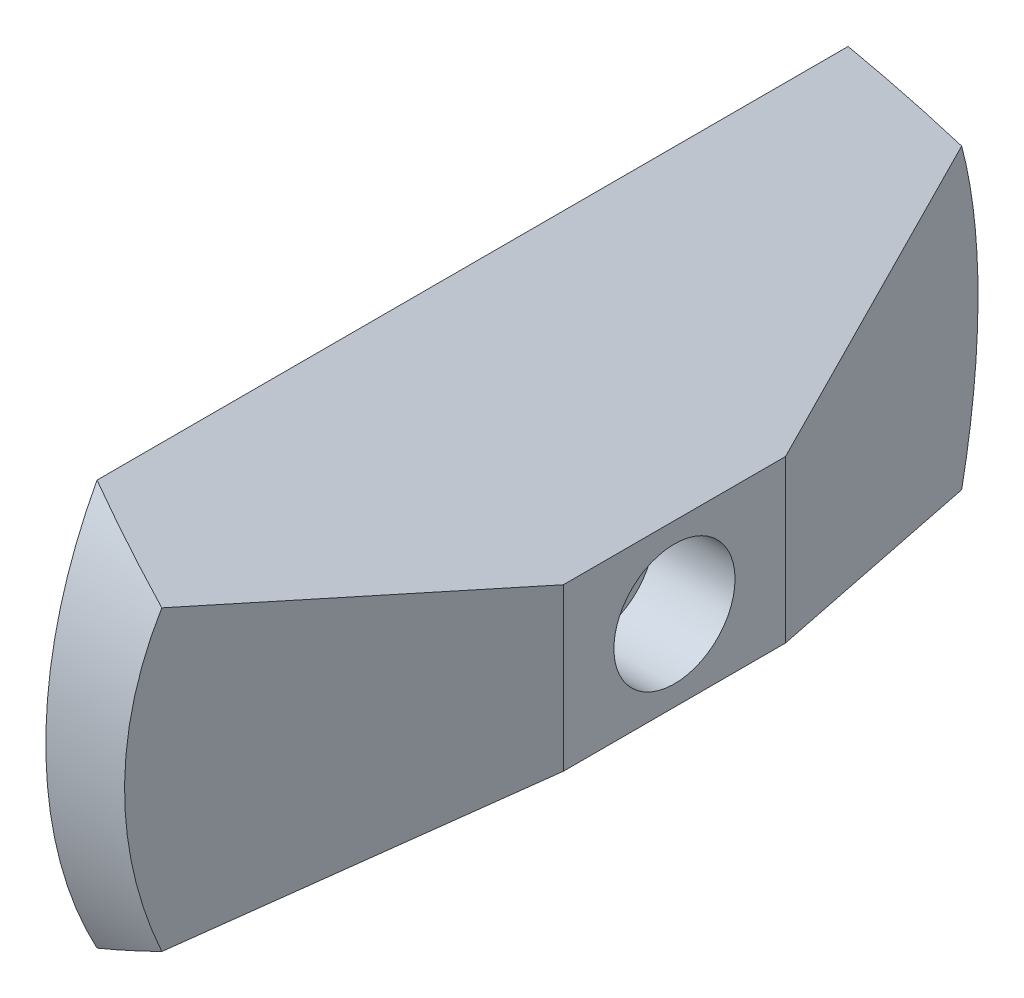
ISO-10303-21;
HEADER;
FILE_DESCRIPTION(('STEP AP214'),'2;1');
FILE_NAME('part.step','',(''),(''),'','','');
FILE_SCHEMA(('AUTOMOTIVE_DESIGN { 1 0 10303 214 1 1 1 1 }'));
ENDSEC;
DATA;
#1=APPLICATION_CONTEXT('core data for automotive mechanical design processes');
#2=APPLICATION_PROTOCOL_DEFINITION('international standard','automotive_design',2000,#1);
#3=PRODUCT_CONTEXT('',#1,'mechanical');
#4=PRODUCT('Part','Part','',(#3));
#5=PRODUCT_RELATED_PRODUCT_CATEGORY('part','',(#4));
#6=PRODUCT_DEFINITION_FORMATION('','',#4);
#7=PRODUCT_DEFINITION_CONTEXT('part definition',#1,'design');
#8=PRODUCT_DEFINITION('design','',#6,#7);
#9=PRODUCT_DEFINITION_SHAPE('','',#8);
#10=(LENGTH_UNIT() NAMED_UNIT(*) SI_UNIT(.MILLI.,.METRE.));
#11=(NAMED_UNIT(*) PLANE_ANGLE_UNIT() SI_UNIT($,.RADIAN.));
#12=(NAMED_UNIT(*) SI_UNIT($,.STERADIAN.) SOLID_ANGLE_UNIT());
#13=UNCERTAINTY_MEASURE_WITH_UNIT(LENGTH_MEASURE(1.E-05),#10,'distance_accuracy_value','');
#14=(GEOMETRIC_REPRESENTATION_CONTEXT(3) GLOBAL_UNCERTAINTY_ASSIGNED_CONTEXT((#13)) GLOBAL_UNIT_ASSIGNED_CONTEXT((#10,
#11,#12)) REPRESENTATION_CONTEXT('',''));
#15=CARTESIAN_POINT('',(0.,0.,0.));
#16=DIRECTION('',(0.,0.,1.));
#17=DIRECTION('',(1.,0.,0.));
#18=AXIS2_PLACEMENT_3D('',#15,#16,#17);
#19=CARTESIAN_POINT('',(55.3,10.66,42.5));
#20=DIRECTION('',(-1.,0.,0.));
#21=DIRECTION('',(0.,0.,1.));
#22=AXIS2_PLACEMENT_3D('',#19,#20,#21);
#23=PLANE('',#22);
#24=CARTESIAN_POINT('',(55.3,10.66,42.5));
#25=DIRECTION('',(-1.,0.,0.));
#26=DIRECTION('',(0.,0.,1.));
#27=AXIS2_PLACEMENT_3D('',#24,#25,#26);
#28=CIRCLE('',#27,1.5);
#29=CARTESIAN_POINT('',(55.3,12.16,42.5));
#30=VERTEX_POINT('',#29);
#31=CARTESIAN_POINT('',(55.3,10.66,41.));
#32=VERTEX_POINT('',#31);
#33=EDGE_CURVE('E146',#30,#32,#28,.T.);
#34=ORIENTED_EDGE('',*,*,#33,.F.);
#35=DIRECTION('',(0.,1.,0.));
#36=VECTOR('',#35,1.);
#37=CARTESIAN_POINT('',(55.3,13.16,42.5));
#38=LINE('',#37,#36);
#39=CARTESIAN_POINT('',(55.3,13.16,42.5));
#40=VERTEX_POINT('',#39);
#41=EDGE_CURVE('E184',#30,#40,#38,.T.);
#42=ORIENTED_EDGE('',*,*,#41,.T.);
#43=CARTESIAN_POINT('',(55.3,10.66,42.5));
#44=DIRECTION('',(-1.,0.,0.));
#45=DIRECTION('',(0.,0.,1.));
#46=AXIS2_PLACEMENT_3D('',#43,#44,#45);
#47=CIRCLE('',#46,2.5);
#48=CARTESIAN_POINT('',(55.3,10.66,40.));
#49=VERTEX_POINT('',#48);
#50=EDGE_CURVE('E441',#40,#49,#47,.T.);
#51=ORIENTED_EDGE('',*,*,#50,.T.);
#52=DIRECTION('',(0.,0.,1.));
#53=VECTOR('',#52,1.);
#54=CARTESIAN_POINT('',(55.3,10.66,40.));
#55=LINE('',#54,#53);
#56=EDGE_CURVE('E444',#49,#32,#55,.T.);
#57=ORIENTED_EDGE('',*,*,#56,.T.);
#58=EDGE_LOOP('',(#34,#42,#51,#57));
#59=FACE_BOUND('',#58,.T.);
#60=ADVANCED_FACE('F38',(#59),#23,.T.);
#61=CARTESIAN_POINT('',(39.3,10.66,42.5));
#62=DIRECTION('',(1.,0.,0.));
#63=DIRECTION('',(0.,0.,-1.));
#64=AXIS2_PLACEMENT_3D('',#61,#62,#63);
#65=CYLINDRICAL_SURFACE('',#64,21.1339271448186);
#66=CARTESIAN_POINT('',(52.3,10.66,42.5));
#67=DIRECTION('',(-1.,0.,0.));
#68=DIRECTION('',(0.,0.,1.));
#69=AXIS2_PLACEMENT_3D('',#66,#67,#68);
#70=CIRCLE('',#69,21.1339271448186);
#71=CARTESIAN_POINT('',(52.3,20.6975,23.9018422871377));
#72=VERTEX_POINT('',#71);
#73=CARTESIAN_POINT('',(52.3,0.622499999999996,23.9018422871377));
#74=VERTEX_POINT('',#73);
#75=EDGE_CURVE('E60',#72,#74,#70,.T.);
#76=ORIENTED_EDGE('',*,*,#75,.F.);
#77=CARTESIAN_POINT('',(68.9252587991718,10.66,42.5));
#78=DIRECTION('',(-0.51685430248884,-0.856073378863503,0.));
#79=DIRECTION('',(0.856073378863503,-0.51685430248884,0.));
#80=AXIS2_PLACEMENT_3D('',#77,#78,#79);
#81=ELLIPSE('',#80,40.8895254292188,21.1339271448186);
#82=CARTESIAN_POINT('',(56.7168174317577,18.0308464755763,22.6930946688791));
#83=VERTEX_POINT('',#82);
#84=EDGE_CURVE('E202',#83,#72,#81,.F.);
#85=ORIENTED_EDGE('',*,*,#84,.F.);
#86=CARTESIAN_POINT('',(64.4463414634146,10.66,42.5));
#87=DIRECTION('',(-0.93157761948506,0.,0.363542485652706));
#88=DIRECTION('',(0.363542485652706,0.,0.93157761948506));
#89=AXIS2_PLACEMENT_3D('',#86,#87,#88);
#90=ELLIPSE('',#89,22.6861688202649,21.1339271448186);
#91=CARTESIAN_POINT('',(56.7168174317577,3.28915352442372,22.6930946688791));
#92=VERTEX_POINT('',#91);
#93=EDGE_CURVE('E198',#92,#83,#90,.F.);
#94=ORIENTED_EDGE('',*,*,#93,.F.);
#95=CARTESIAN_POINT('',(68.9252587991718,10.66,42.5));
#96=DIRECTION('',(-0.51685430248884,0.856073378863503,0.));
#97=DIRECTION('',(0.856073378863503,0.51685430248884,0.));
#98=AXIS2_PLACEMENT_3D('',#95,#96,#97);
#99=ELLIPSE('',#98,40.8895254292188,21.1339271448186);
#100=EDGE_CURVE('E196',#74,#92,#99,.F.);
#101=ORIENTED_EDGE('',*,*,#100,.F.);
#102=EDGE_LOOP('',(#76,#85,#94,#101));
#103=FACE_BOUND('',#102,.T.);
#104=ADVANCED_FACE('F251',(#103),#65,.T.);
#105=CARTESIAN_POINT('',(52.3,10.66,42.5));
#106=DIRECTION('',(-1.,0.,0.));
#107=DIRECTION('',(0.,0.,1.));
#108=AXIS2_PLACEMENT_3D('',#105,#106,#107);
#109=CIRCLE('',#108,21.1339271448186);
#110=CARTESIAN_POINT('',(52.3,0.6225,61.0981577128623));
#111=VERTEX_POINT('',#110);
#112=CARTESIAN_POINT('',(52.3,20.6975,61.0981577128623));
#113=VERTEX_POINT('',#112);
#114=EDGE_CURVE('E187',#111,#113,#109,.T.);
#115=ORIENTED_EDGE('',*,*,#114,.F.);
#116=CARTESIAN_POINT('',(56.7168174317577,3.28915352442372,62.3069053311208));
#117=VERTEX_POINT('',#116);
#118=EDGE_CURVE('E199',#117,#111,#99,.F.);
#119=ORIENTED_EDGE('',*,*,#118,.F.);
#120=CARTESIAN_POINT('',(64.4463414634146,10.66,42.5));
#121=DIRECTION('',(-0.93157761948506,0.,-0.363542485652706));
#122=DIRECTION('',(0.363542485652706,0.,-0.93157761948506));
#123=AXIS2_PLACEMENT_3D('',#120,#121,#122);
#124=ELLIPSE('',#123,22.6861688202649,21.1339271448186);
#125=CARTESIAN_POINT('',(56.7168174317577,18.0308464755763,62.3069053311209));
#126=VERTEX_POINT('',#125);
#127=EDGE_CURVE('E206',#126,#117,#124,.F.);
#128=ORIENTED_EDGE('',*,*,#127,.F.);
#129=EDGE_CURVE('E205',#113,#126,#81,.F.);
#130=ORIENTED_EDGE('',*,*,#129,.F.);
#131=EDGE_LOOP('',(#115,#119,#128,#130));
#132=FACE_BOUND('',#131,.T.);
#133=ADVANCED_FACE('F247',(#132),#65,.T.);
#134=CARTESIAN_POINT('',(62.3,14.66,-8.00000000000005));
#135=DIRECTION('',(-0.51685430248884,-0.856073378863503,0.));
#136=DIRECTION('',(0.856073378863503,-0.51685430248884,0.));
#137=AXIS2_PLACEMENT_3D('',#134,#135,#136);
#138=PLANE('',#137);
#139=DIRECTION('',(0.,0.,-1.));
#140=VECTOR('',#139,1.);
#141=CARTESIAN_POINT('',(52.3,20.6975,-8.00000000000004));
#142=LINE('',#141,#140);
#143=EDGE_CURVE('E194',#113,#72,#142,.T.);
#144=ORIENTED_EDGE('',*,*,#143,.F.);
#145=ORIENTED_EDGE('',*,*,#129,.T.);
#146=DIRECTION('',(-0.355089807819902,0.214385471471266,0.9099176325385));
#147=VECTOR('',#146,1.);
#148=CARTESIAN_POINT('',(49.725674313885,22.2517491329919,80.2217095706697));
#149=LINE('',#148,#147);
#150=CARTESIAN_POINT('',(62.3,14.66,47.9999999999999));
#151=VERTEX_POINT('',#150);
#152=EDGE_CURVE('E226',#151,#126,#149,.T.);
#153=ORIENTED_EDGE('',*,*,#152,.F.);
#154=DIRECTION('',(0.,0.,1.));
#155=VECTOR('',#154,1.);
#156=CARTESIAN_POINT('',(62.3,14.66,-8.00000000000005));
#157=LINE('',#156,#155);
#158=CARTESIAN_POINT('',(62.3,14.66,37.));
#159=VERTEX_POINT('',#158);
#160=EDGE_CURVE('E215',#159,#151,#157,.T.);
#161=ORIENTED_EDGE('',*,*,#160,.F.);
#162=DIRECTION('',(0.355089807819902,-0.214385471471266,0.9099176325385));
#163=VECTOR('',#162,1.);
#164=CARTESIAN_POINT('',(49.725674313885,22.2517491329919,4.7782904293303));
#165=LINE('',#164,#163);
#166=EDGE_CURVE('E218',#83,#159,#165,.T.);
#167=ORIENTED_EDGE('',*,*,#166,.F.);
#168=ORIENTED_EDGE('',*,*,#84,.T.);
#169=EDGE_LOOP('',(#144,#145,#153,#161,#167,#168));
#170=FACE_BOUND('',#169,.T.);
#171=ADVANCED_FACE('F243',(#170),#138,.F.);
#172=CARTESIAN_POINT('',(62.3,6.66,-8.00000000000005));
#173=DIRECTION('',(-0.51685430248884,0.856073378863503,0.));
#174=DIRECTION('',(-0.856073378863503,-0.51685430248884,0.));
#175=AXIS2_PLACEMENT_3D('',#172,#173,#174);
#176=PLANE('',#175);
#177=DIRECTION('',(0.,0.,1.));
#178=VECTOR('',#177,1.);
#179=CARTESIAN_POINT('',(52.3,0.622499999999992,-8.00000000000004));
#180=LINE('',#179,#178);
#181=EDGE_CURVE('E11',#74,#111,#180,.T.);
#182=ORIENTED_EDGE('',*,*,#181,.F.);
#183=ORIENTED_EDGE('',*,*,#100,.T.);
#184=DIRECTION('',(-0.355089807819902,-0.214385471471266,-0.9099176325385));
#185=VECTOR('',#184,1.);
#186=CARTESIAN_POINT('',(44.9540906251225,-3.81259278508228,-7.44889277312355));
#187=LINE('',#186,#185);
#188=CARTESIAN_POINT('',(62.3,6.66,37.));
#189=VERTEX_POINT('',#188);
#190=EDGE_CURVE('E212',#189,#92,#187,.T.);
#191=ORIENTED_EDGE('',*,*,#190,.F.);
#192=DIRECTION('',(0.,0.,1.));
#193=VECTOR('',#192,1.);
#194=CARTESIAN_POINT('',(62.3,6.66,-8.00000000000005));
#195=LINE('',#194,#193);
#196=CARTESIAN_POINT('',(62.3,6.66,48.));
#197=VERTEX_POINT('',#196);
#198=EDGE_CURVE('E209',#189,#197,#195,.T.);
#199=ORIENTED_EDGE('',*,*,#198,.T.);
#200=DIRECTION('',(0.355089807819902,0.214385471471266,-0.9099176325385));
#201=VECTOR('',#200,1.);
#202=CARTESIAN_POINT('',(44.9540906251225,-3.81259278508229,92.4488927731236));
#203=LINE('',#202,#201);
#204=EDGE_CURVE('E46',#117,#197,#203,.T.);
#205=ORIENTED_EDGE('',*,*,#204,.F.);
#206=ORIENTED_EDGE('',*,*,#118,.T.);
#207=EDGE_LOOP('',(#182,#183,#191,#199,#205,#206));
#208=FACE_BOUND('',#207,.T.);
#209=ADVANCED_FACE('F236',(#208),#176,.F.);
#210=CARTESIAN_POINT('',(46.3,-20.68,-4.));
#211=DIRECTION('',(-0.93157761948506,0.,0.363542485652706));
#212=DIRECTION('',(0.363542485652706,0.,0.93157761948506));
#213=AXIS2_PLACEMENT_3D('',#210,#211,#212);
#214=PLANE('',#213);
#215=ORIENTED_EDGE('',*,*,#190,.T.);
#216=ORIENTED_EDGE('',*,*,#93,.T.);
#217=ORIENTED_EDGE('',*,*,#166,.T.);
#218=DIRECTION('',(0.,1.,0.));
#219=VECTOR('',#218,1.);
#220=CARTESIAN_POINT('',(62.3,0.,37.));
#221=LINE('',#220,#219);
#222=EDGE_CURVE('E220',#189,#159,#221,.T.);
#223=ORIENTED_EDGE('',*,*,#222,.F.);
#224=EDGE_LOOP('',(#215,#216,#217,#223));
#225=FACE_BOUND('',#224,.T.);
#226=ADVANCED_FACE('F253',(#225),#214,.F.);
#227=CARTESIAN_POINT('',(46.3,-20.68,89.));
#228=DIRECTION('',(-0.93157761948506,0.,-0.363542485652706));
#229=DIRECTION('',(-0.363542485652706,0.,0.93157761948506));
#230=AXIS2_PLACEMENT_3D('',#227,#228,#229);
#231=PLANE('',#230);
#232=ORIENTED_EDGE('',*,*,#152,.T.);
#233=ORIENTED_EDGE('',*,*,#127,.T.);
#234=ORIENTED_EDGE('',*,*,#204,.T.);
#235=DIRECTION('',(0.,-1.,0.));
#236=VECTOR('',#235,1.);
#237=CARTESIAN_POINT('',(62.3,0.,48.));
#238=LINE('',#237,#236);
#239=EDGE_CURVE('E223',#151,#197,#238,.T.);
#240=ORIENTED_EDGE('',*,*,#239,.F.);
#241=EDGE_LOOP('',(#232,#233,#234,#240));
#242=FACE_BOUND('',#241,.T.);
#243=ADVANCED_FACE('F231',(#242),#231,.F.);
#244=CARTESIAN_POINT('',(62.3,0.,0.));
#245=DIRECTION('',(-1.,0.,0.));
#246=DIRECTION('',(0.,0.,1.));
#247=AXIS2_PLACEMENT_3D('',#244,#245,#246);
#248=PLANE('',#247);
#249=CARTESIAN_POINT('',(62.3,10.66,42.5));
#250=DIRECTION('',(1.,0.,0.));
#251=DIRECTION('',(0.,0.,-1.));
#252=AXIS2_PLACEMENT_3D('',#249,#250,#251);
#253=CIRCLE('',#252,3.);
#254=CARTESIAN_POINT('',(62.3,10.66,39.5));
#255=VERTEX_POINT('',#254);
#256=EDGE_CURVE('E437',#255,#255,#253,.T.);
#257=ORIENTED_EDGE('',*,*,#256,.F.);
#258=EDGE_LOOP('',(#257));
#259=FACE_BOUND('',#258,.T.);
#260=ORIENTED_EDGE('',*,*,#239,.T.);
#261=ORIENTED_EDGE('',*,*,#198,.F.);
#262=ORIENTED_EDGE('',*,*,#222,.T.);
#263=ORIENTED_EDGE('',*,*,#160,.T.);
#264=EDGE_LOOP('',(#260,#261,#262,#263));
#265=FACE_BOUND('',#264,.T.);
#266=ADVANCED_FACE('F40',(#259,#265),#248,.F.);
#267=CARTESIAN_POINT('',(52.3,11.7228152902028,40.7144703124594));
#268=DIRECTION('',(-1.,0.,0.));
#269=DIRECTION('',(0.,0.,1.));
#270=AXIS2_PLACEMENT_3D('',#267,#268,#269);
#271=PLANE('',#270);
#272=CARTESIAN_POINT('',(52.3,10.66,42.5));
#273=DIRECTION('',(-1.,0.,0.));
#274=DIRECTION('',(0.,0.,1.));
#275=AXIS2_PLACEMENT_3D('',#272,#273,#274);
#276=CIRCLE('',#275,1.5);
#277=CARTESIAN_POINT('',(52.3,10.66,44.));
#278=VERTEX_POINT('',#277);
#279=CARTESIAN_POINT('',(52.3,12.16,42.5));
#280=VERTEX_POINT('',#279);
#281=EDGE_CURVE('E424',#278,#280,#276,.T.);
#282=ORIENTED_EDGE('',*,*,#281,.F.);
#283=DIRECTION('',(0.,0.,-1.));
#284=VECTOR('',#283,1.);
#285=CARTESIAN_POINT('',(52.3,10.66,43.5));
#286=LINE('',#285,#284);
#287=CARTESIAN_POINT('',(52.3,10.66,45.));
#288=VERTEX_POINT('',#287);
#289=EDGE_CURVE('E153',#288,#278,#286,.T.);
#290=ORIENTED_EDGE('',*,*,#289,.F.);
#291=CARTESIAN_POINT('',(52.3,10.66,42.5));
#292=DIRECTION('',(-1.,0.,0.));
#293=DIRECTION('',(0.,0.,1.));
#294=AXIS2_PLACEMENT_3D('',#291,#292,#293);
#295=CIRCLE('',#294,2.5);
#296=CARTESIAN_POINT('',(52.3,8.15999999999999,42.5));
#297=VERTEX_POINT('',#296);
#298=EDGE_CURVE('E180',#297,#288,#295,.T.);
#299=ORIENTED_EDGE('',*,*,#298,.F.);
#300=DIRECTION('',(0.,-1.,0.));
#301=VECTOR('',#300,1.);
#302=CARTESIAN_POINT('',(52.3,9.65999999999999,42.5));
#303=LINE('',#302,#301);
#304=CARTESIAN_POINT('',(52.3,9.15999999999999,42.5));
#305=VERTEX_POINT('',#304);
#306=EDGE_CURVE('E178',#305,#297,#303,.T.);
#307=ORIENTED_EDGE('',*,*,#306,.F.);
#308=CARTESIAN_POINT('',(52.3,10.66,41.));
#309=VERTEX_POINT('',#308);
#310=EDGE_CURVE('E154',#309,#305,#276,.T.);
#311=ORIENTED_EDGE('',*,*,#310,.F.);
#312=DIRECTION('',(0.,0.,1.));
#313=VECTOR('',#312,1.);
#314=CARTESIAN_POINT('',(52.3,10.66,40.));
#315=LINE('',#314,#313);
#316=CARTESIAN_POINT('',(52.3,10.66,40.));
#317=VERTEX_POINT('',#316);
#318=EDGE_CURVE('E175',#317,#309,#315,.T.);
#319=ORIENTED_EDGE('',*,*,#318,.F.);
#320=CARTESIAN_POINT('',(52.3,10.66,42.5));
#321=DIRECTION('',(-1.,0.,0.));
#322=DIRECTION('',(0.,0.,1.));
#323=AXIS2_PLACEMENT_3D('',#320,#321,#322);
#324=CIRCLE('',#323,2.5);
#325=CARTESIAN_POINT('',(52.3,13.16,42.5));
#326=VERTEX_POINT('',#325);
#327=EDGE_CURVE('E171',#326,#317,#324,.T.);
#328=ORIENTED_EDGE('',*,*,#327,.F.);
#329=DIRECTION('',(0.,1.,0.));
#330=VECTOR('',#329,1.);
#331=CARTESIAN_POINT('',(52.3,13.16,42.5));
#332=LINE('',#331,#330);
#333=EDGE_CURVE('E169',#280,#326,#332,.T.);
#334=ORIENTED_EDGE('',*,*,#333,.F.);
#335=EDGE_LOOP('',(#282,#290,#299,#307,#311,#319,#328,#334));
#336=FACE_BOUND('',#335,.T.);
#337=ORIENTED_EDGE('',*,*,#143,.T.);
#338=ORIENTED_EDGE('',*,*,#75,.T.);
#339=ORIENTED_EDGE('',*,*,#181,.T.);
#340=ORIENTED_EDGE('',*,*,#114,.T.);
#341=EDGE_LOOP('',(#337,#338,#339,#340));
#342=FACE_BOUND('',#341,.T.);
#343=ADVANCED_FACE('F294',(#336,#342),#271,.T.);
#344=CARTESIAN_POINT('',(55.3,10.66,43.5));
#345=DIRECTION('',(0.,1.,0.));
#346=DIRECTION('',(0.,0.,1.));
#347=AXIS2_PLACEMENT_3D('',#344,#345,#346);
#348=PLANE('',#347);
#349=ORIENTED_EDGE('',*,*,#289,.T.);
#350=DIRECTION('',(1.,0.,0.));
#351=VECTOR('',#350,1.);
#352=CARTESIAN_POINT('',(49.3,10.66,44.));
#353=LINE('',#352,#351);
#354=CARTESIAN_POINT('',(55.3,10.66,44.));
#355=VERTEX_POINT('',#354);
#356=EDGE_CURVE('E139',#278,#355,#353,.T.);
#357=ORIENTED_EDGE('',*,*,#356,.T.);
#358=DIRECTION('',(0.,0.,-1.));
#359=VECTOR('',#358,1.);
#360=CARTESIAN_POINT('',(55.3,10.66,43.5));
#361=LINE('',#360,#359);
#362=CARTESIAN_POINT('',(55.3,10.66,45.));
#363=VERTEX_POINT('',#362);
#364=EDGE_CURVE('E151',#363,#355,#361,.T.);
#365=ORIENTED_EDGE('',*,*,#364,.F.);
#366=DIRECTION('',(-1.,0.,0.));
#367=VECTOR('',#366,1.);
#368=CARTESIAN_POINT('',(55.3,10.66,45.));
#369=LINE('',#368,#367);
#370=EDGE_CURVE('E185',#363,#288,#369,.T.);
#371=ORIENTED_EDGE('',*,*,#370,.T.);
#372=EDGE_LOOP('',(#349,#357,#365,#371));
#373=FACE_BOUND('',#372,.T.);
#374=ADVANCED_FACE('F150',(#373),#348,.F.);
#375=CARTESIAN_POINT('',(55.3,10.66,42.5));
#376=DIRECTION('',(-1.,0.,0.));
#377=DIRECTION('',(0.,0.,1.));
#378=AXIS2_PLACEMENT_3D('',#375,#376,#377);
#379=CYLINDRICAL_SURFACE('',#378,2.5);
#380=ORIENTED_EDGE('',*,*,#298,.T.);
#381=ORIENTED_EDGE('',*,*,#370,.F.);
#382=CARTESIAN_POINT('',(55.3,10.66,42.5));
#383=DIRECTION('',(-1.,0.,0.));
#384=DIRECTION('',(0.,0.,1.));
#385=AXIS2_PLACEMENT_3D('',#382,#383,#384);
#386=CIRCLE('',#385,2.5);
#387=CARTESIAN_POINT('',(55.3,8.15999999999999,42.5));
#388=VERTEX_POINT('',#387);
#389=EDGE_CURVE('E159',#388,#363,#386,.T.);
#390=ORIENTED_EDGE('',*,*,#389,.F.);
#391=DIRECTION('',(-1.,0.,0.));
#392=VECTOR('',#391,1.);
#393=CARTESIAN_POINT('',(55.3,8.15999999999999,42.5));
#394=LINE('',#393,#392);
#395=EDGE_CURVE('E188',#388,#297,#394,.T.);
#396=ORIENTED_EDGE('',*,*,#395,.T.);
#397=EDGE_LOOP('',(#380,#381,#390,#396));
#398=FACE_BOUND('',#397,.T.);
#399=ADVANCED_FACE('F349',(#398),#379,.F.);
#400=CARTESIAN_POINT('',(55.3,9.65999999999999,42.5));
#401=DIRECTION('',(0.,0.,-1.));
#402=DIRECTION('',(-1.,0.,0.));
#403=AXIS2_PLACEMENT_3D('',#400,#401,#402);
#404=PLANE('',#403);
#405=DIRECTION('',(0.,-1.,0.));
#406=VECTOR('',#405,1.);
#407=CARTESIAN_POINT('',(55.3,9.65999999999999,42.5));
#408=LINE('',#407,#406);
#409=CARTESIAN_POINT('',(55.3,9.15999999999999,42.5));
#410=VERTEX_POINT('',#409);
#411=EDGE_CURVE('E165',#410,#388,#408,.T.);
#412=ORIENTED_EDGE('',*,*,#411,.F.);
#413=DIRECTION('',(1.,0.,0.));
#414=VECTOR('',#413,1.);
#415=CARTESIAN_POINT('',(49.3,9.15999999999999,42.5));
#416=LINE('',#415,#414);
#417=EDGE_CURVE('E53',#410,#305,#416,.F.);
#418=ORIENTED_EDGE('',*,*,#417,.T.);
#419=ORIENTED_EDGE('',*,*,#306,.T.);
#420=ORIENTED_EDGE('',*,*,#395,.F.);
#421=EDGE_LOOP('',(#412,#418,#419,#420));
#422=FACE_BOUND('',#421,.T.);
#423=ADVANCED_FACE('F355',(#422),#404,.F.);
#424=CARTESIAN_POINT('',(55.3,10.66,40.));
#425=DIRECTION('',(0.,-1.,0.));
#426=DIRECTION('',(0.,0.,-1.));
#427=AXIS2_PLACEMENT_3D('',#424,#425,#426);
#428=PLANE('',#427);
#429=ORIENTED_EDGE('',*,*,#318,.T.);
#430=DIRECTION('',(1.,0.,0.));
#431=VECTOR('',#430,1.);
#432=CARTESIAN_POINT('',(49.3,10.66,41.));
#433=LINE('',#432,#431);
#434=EDGE_CURVE('E429',#309,#32,#433,.T.);
#435=ORIENTED_EDGE('',*,*,#434,.T.);
#436=ORIENTED_EDGE('',*,*,#56,.F.);
#437=DIRECTION('',(-1.,0.,0.));
#438=VECTOR('',#437,1.);
#439=CARTESIAN_POINT('',(55.3,10.66,40.));
#440=LINE('',#439,#438);
#441=EDGE_CURVE('E163',#49,#317,#440,.T.);
#442=ORIENTED_EDGE('',*,*,#441,.T.);
#443=EDGE_LOOP('',(#429,#435,#436,#442));
#444=FACE_BOUND('',#443,.T.);
#445=ADVANCED_FACE('F288',(#444),#428,.F.);
#446=CARTESIAN_POINT('',(55.3,10.66,42.5));
#447=DIRECTION('',(-1.,0.,0.));
#448=DIRECTION('',(0.,0.,1.));
#449=AXIS2_PLACEMENT_3D('',#446,#447,#448);
#450=CYLINDRICAL_SURFACE('',#449,2.5);
#451=ORIENTED_EDGE('',*,*,#327,.T.);
#452=ORIENTED_EDGE('',*,*,#441,.F.);
#453=ORIENTED_EDGE('',*,*,#50,.F.);
#454=DIRECTION('',(-1.,0.,0.));
#455=VECTOR('',#454,1.);
#456=CARTESIAN_POINT('',(55.3,13.16,42.5));
#457=LINE('',#456,#455);
#458=EDGE_CURVE('E160',#40,#326,#457,.T.);
#459=ORIENTED_EDGE('',*,*,#458,.T.);
#460=EDGE_LOOP('',(#451,#452,#453,#459));
#461=FACE_BOUND('',#460,.T.);
#462=ADVANCED_FACE('F282',(#461),#450,.F.);
#463=CARTESIAN_POINT('',(55.3,13.16,42.5));
#464=DIRECTION('',(0.,0.,1.));
#465=DIRECTION('',(1.,0.,0.));
#466=AXIS2_PLACEMENT_3D('',#463,#464,#465);
#467=PLANE('',#466);
#468=ORIENTED_EDGE('',*,*,#41,.F.);
#469=DIRECTION('',(1.,0.,0.));
#470=VECTOR('',#469,1.);
#471=CARTESIAN_POINT('',(49.3,12.16,42.5));
#472=LINE('',#471,#470);
#473=EDGE_CURVE('E427',#30,#280,#472,.F.);
#474=ORIENTED_EDGE('',*,*,#473,.T.);
#475=ORIENTED_EDGE('',*,*,#333,.T.);
#476=ORIENTED_EDGE('',*,*,#458,.F.);
#477=EDGE_LOOP('',(#468,#474,#475,#476));
#478=FACE_BOUND('',#477,.T.);
#479=ADVANCED_FACE('F275',(#478),#467,.F.);
#480=EDGE_CURVE('E135',#410,#355,#28,.T.);
#481=ORIENTED_EDGE('',*,*,#480,.F.);
#482=ORIENTED_EDGE('',*,*,#411,.T.);
#483=ORIENTED_EDGE('',*,*,#389,.T.);
#484=ORIENTED_EDGE('',*,*,#364,.T.);
#485=EDGE_LOOP('',(#481,#482,#483,#484));
#486=FACE_BOUND('',#485,.T.);
#487=ADVANCED_FACE('F157',(#486),#23,.T.);
#488=CARTESIAN_POINT('',(58.3,10.66,42.5));
#489=DIRECTION('',(1.,0.,0.));
#490=DIRECTION('',(0.,0.,-1.));
#491=AXIS2_PLACEMENT_3D('',#488,#489,#490);
#492=CYLINDRICAL_SURFACE('',#491,3.);
#493=CARTESIAN_POINT('',(58.3,10.66,42.5));
#494=DIRECTION('',(1.,0.,0.));
#495=DIRECTION('',(0.,0.,-1.));
#496=AXIS2_PLACEMENT_3D('',#493,#494,#495);
#497=CIRCLE('',#496,3.);
#498=CARTESIAN_POINT('',(58.3,10.66,39.5));
#499=VERTEX_POINT('',#498);
#500=EDGE_CURVE('E172',#499,#499,#497,.T.);
#501=ORIENTED_EDGE('',*,*,#500,.F.);
#502=EDGE_LOOP('',(#501));
#503=FACE_BOUND('',#502,.T.);
#504=ORIENTED_EDGE('',*,*,#256,.T.);
#505=EDGE_LOOP('',(#504));
#506=FACE_BOUND('',#505,.T.);
#507=ADVANCED_FACE('F274',(#503,#506),#492,.F.);
#508=CARTESIAN_POINT('',(58.3,10.66,42.5));
#509=DIRECTION('',(1.,0.,0.));
#510=DIRECTION('',(0.,0.,-1.));
#511=AXIS2_PLACEMENT_3D('',#508,#509,#510);
#512=PLANE('',#511);
#513=CARTESIAN_POINT('',(58.3,10.66,42.5));
#514=DIRECTION('',(1.,0.,0.));
#515=DIRECTION('',(0.,0.,-1.));
#516=AXIS2_PLACEMENT_3D('',#513,#514,#515);
#517=CIRCLE('',#516,1.5);
#518=CARTESIAN_POINT('',(58.3,10.66,41.));
#519=VERTEX_POINT('',#518);
#520=EDGE_CURVE('E144',#519,#519,#517,.T.);
#521=ORIENTED_EDGE('',*,*,#520,.F.);
#522=EDGE_LOOP('',(#521));
#523=FACE_BOUND('',#522,.T.);
#524=ORIENTED_EDGE('',*,*,#500,.T.);
#525=EDGE_LOOP('',(#524));
#526=FACE_BOUND('',#525,.T.);
#527=ADVANCED_FACE('F280',(#523,#526),#512,.T.);
#528=CARTESIAN_POINT('',(49.3,10.66,42.5));
#529=DIRECTION('',(1.,0.,0.));
#530=DIRECTION('',(0.,0.,-1.));
#531=AXIS2_PLACEMENT_3D('',#528,#529,#530);
#532=CYLINDRICAL_SURFACE('',#531,1.5);
#533=ORIENTED_EDGE('',*,*,#33,.T.);
#534=ORIENTED_EDGE('',*,*,#434,.F.);
#535=ORIENTED_EDGE('',*,*,#310,.T.);
#536=ORIENTED_EDGE('',*,*,#417,.F.);
#537=ORIENTED_EDGE('',*,*,#480,.T.);
#538=ORIENTED_EDGE('',*,*,#356,.F.);
#539=ORIENTED_EDGE('',*,*,#281,.T.);
#540=ORIENTED_EDGE('',*,*,#473,.F.);
#541=EDGE_LOOP('',(#533,#534,#535,#536,#537,#538,#539,#540));
#542=FACE_BOUND('',#541,.T.);
#543=ORIENTED_EDGE('',*,*,#520,.T.);
#544=EDGE_LOOP('',(#543));
#545=FACE_BOUND('',#544,.T.);
#546=ADVANCED_FACE('F137',(#542,#545),#532,.F.);
#547=CLOSED_SHELL('',(#60,#104,#133,#171,#209,#226,#243,#266,#343,#374,#399,#423,#445,#462,#479,
#487,#507,#527,#546));
#548=MANIFOLD_SOLID_BREP('B2',#547);
#549=ADVANCED_BREP_SHAPE_REPRESENTATION('',(#18,#548),#14);
#550=SHAPE_DEFINITION_REPRESENTATION(#9,#549);
ENDSEC;
END-ISO-10303-21;
